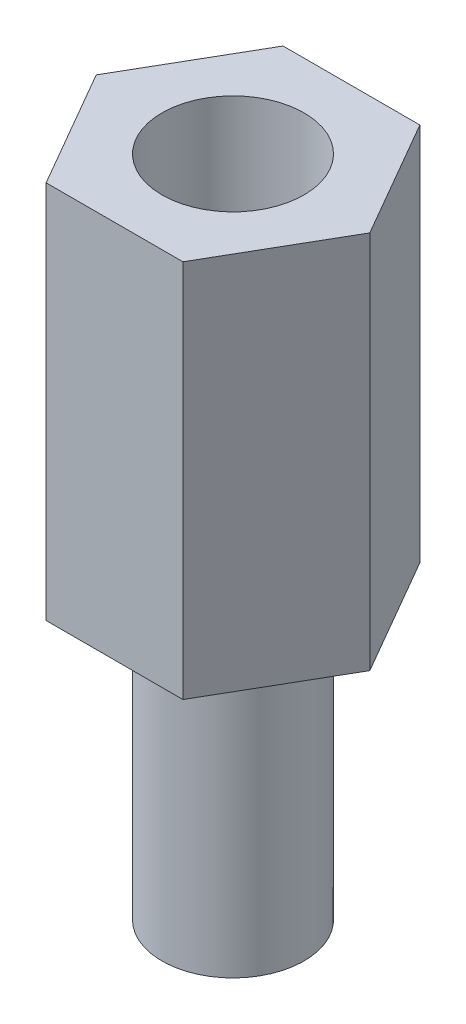
ISO-10303-21;
HEADER;
FILE_DESCRIPTION(('STEP AP214'),'2;1');
FILE_NAME('part.step','',(''),(''),'','','');
FILE_SCHEMA(('AUTOMOTIVE_DESIGN { 1 0 10303 214 1 1 1 1 }'));
ENDSEC;
DATA;
#1=APPLICATION_CONTEXT('core data for automotive mechanical design processes');
#2=APPLICATION_PROTOCOL_DEFINITION('international standard','automotive_design',2000,#1);
#3=PRODUCT_CONTEXT('',#1,'mechanical');
#4=PRODUCT('Part','Part','',(#3));
#5=PRODUCT_RELATED_PRODUCT_CATEGORY('part','',(#4));
#6=PRODUCT_DEFINITION_FORMATION('','',#4);
#7=PRODUCT_DEFINITION_CONTEXT('part definition',#1,'design');
#8=PRODUCT_DEFINITION('design','',#6,#7);
#9=PRODUCT_DEFINITION_SHAPE('','',#8);
#10=(LENGTH_UNIT() NAMED_UNIT(*) SI_UNIT(.MILLI.,.METRE.));
#11=(NAMED_UNIT(*) PLANE_ANGLE_UNIT() SI_UNIT($,.RADIAN.));
#12=(NAMED_UNIT(*) SI_UNIT($,.STERADIAN.) SOLID_ANGLE_UNIT());
#13=UNCERTAINTY_MEASURE_WITH_UNIT(LENGTH_MEASURE(1.E-05),#10,'distance_accuracy_value','');
#14=(GEOMETRIC_REPRESENTATION_CONTEXT(3) GLOBAL_UNCERTAINTY_ASSIGNED_CONTEXT((#13)) GLOBAL_UNIT_ASSIGNED_CONTEXT((#10,
#11,#12)) REPRESENTATION_CONTEXT('',''));
#15=CARTESIAN_POINT('',(0.,0.,0.));
#16=DIRECTION('',(0.,0.,1.));
#17=DIRECTION('',(1.,0.,0.));
#18=AXIS2_PLACEMENT_3D('',#15,#16,#17);
#19=CARTESIAN_POINT('',(0.,-6.,0.));
#20=DIRECTION('',(0.,1.,0.));
#21=DIRECTION('',(0.,0.,1.));
#22=AXIS2_PLACEMENT_3D('',#19,#20,#21);
#23=CYLINDRICAL_SURFACE('',#22,1.5);
#24=CARTESIAN_POINT('',(0.,-6.,0.));
#25=DIRECTION('',(0.,-1.,0.));
#26=DIRECTION('',(0.,0.,-1.));
#27=AXIS2_PLACEMENT_3D('',#24,#25,#26);
#28=CIRCLE('',#27,1.5);
#29=CARTESIAN_POINT('',(0.,-6.,-1.5));
#30=VERTEX_POINT('',#29);
#31=EDGE_CURVE('E11',#30,#30,#28,.T.);
#32=ORIENTED_EDGE('',*,*,#31,.F.);
#33=EDGE_LOOP('',(#32));
#34=FACE_BOUND('',#33,.T.);
#35=CARTESIAN_POINT('',(0.,0.,0.));
#36=DIRECTION('',(0.,-1.,0.));
#37=DIRECTION('',(0.,0.,-1.));
#38=AXIS2_PLACEMENT_3D('',#35,#36,#37);
#39=CIRCLE('',#38,1.5);
#40=CARTESIAN_POINT('',(0.,0.,-1.5));
#41=VERTEX_POINT('',#40);
#42=EDGE_CURVE('E43',#41,#41,#39,.T.);
#43=ORIENTED_EDGE('',*,*,#42,.T.);
#44=EDGE_LOOP('',(#43));
#45=FACE_BOUND('',#44,.T.);
#46=ADVANCED_FACE('F40',(#34,#45),#23,.T.);
#47=CARTESIAN_POINT('',(0.,-6.,0.));
#48=DIRECTION('',(0.,-1.,0.));
#49=DIRECTION('',(0.,0.,-1.));
#50=AXIS2_PLACEMENT_3D('',#47,#48,#49);
#51=PLANE('',#50);
#52=ORIENTED_EDGE('',*,*,#31,.T.);
#53=EDGE_LOOP('',(#52));
#54=FACE_BOUND('',#53,.T.);
#55=ADVANCED_FACE('F55',(#54),#51,.T.);
#56=CARTESIAN_POINT('',(0.,0.,0.));
#57=DIRECTION('',(0.,-1.,0.));
#58=DIRECTION('',(0.,0.,-1.));
#59=AXIS2_PLACEMENT_3D('',#56,#57,#58);
#60=PLANE('',#59);
#61=ORIENTED_EDGE('',*,*,#42,.F.);
#62=EDGE_LOOP('',(#61));
#63=FACE_BOUND('',#62,.T.);
#64=ADVANCED_FACE('F53',(#63),#60,.F.);
#65=CLOSED_SHELL('',(#46,#55,#64));
#66=MANIFOLD_SOLID_BREP('B2',#65);
#67=CARTESIAN_POINT('',(0.,8.,0.));
#68=DIRECTION('',(0.,1.,0.));
#69=DIRECTION('',(0.,0.,1.));
#70=AXIS2_PLACEMENT_3D('',#67,#68,#69);
#71=PLANE('',#70);
#72=DIRECTION('',(1.,0.,0.));
#73=VECTOR('',#72,1.);
#74=CARTESIAN_POINT('',(-1.44337567297405,8.,2.5));
#75=LINE('',#74,#73);
#76=CARTESIAN_POINT('',(-1.44337567297405,8.,2.5));
#77=VERTEX_POINT('',#76);
#78=CARTESIAN_POINT('',(1.44337567297408,8.,2.5));
#79=VERTEX_POINT('',#78);
#80=EDGE_CURVE('E176',#77,#79,#75,.T.);
#81=ORIENTED_EDGE('',*,*,#80,.T.);
#82=DIRECTION('',(0.500000000000001,0.,-0.866025403784438));
#83=VECTOR('',#82,1.);
#84=CARTESIAN_POINT('',(1.44337567297408,8.,2.5));
#85=LINE('',#84,#83);
#86=CARTESIAN_POINT('',(2.88675134594815,8.,0.));
#87=VERTEX_POINT('',#86);
#88=EDGE_CURVE('E134',#79,#87,#85,.T.);
#89=ORIENTED_EDGE('',*,*,#88,.T.);
#90=DIRECTION('',(-0.500000000000001,0.,-0.866025403784438));
#91=VECTOR('',#90,1.);
#92=CARTESIAN_POINT('',(2.88675134594815,8.,0.));
#93=LINE('',#92,#91);
#94=CARTESIAN_POINT('',(1.44337567297408,8.,-2.50000000000001));
#95=VERTEX_POINT('',#94);
#96=EDGE_CURVE('E147',#87,#95,#93,.T.);
#97=ORIENTED_EDGE('',*,*,#96,.T.);
#98=DIRECTION('',(-1.,0.,0.));
#99=VECTOR('',#98,1.);
#100=CARTESIAN_POINT('',(1.44337567297408,8.,-2.50000000000001));
#101=LINE('',#100,#99);
#102=CARTESIAN_POINT('',(-1.44337567297405,8.,-2.50000000000001));
#103=VERTEX_POINT('',#102);
#104=EDGE_CURVE('E141',#95,#103,#101,.T.);
#105=ORIENTED_EDGE('',*,*,#104,.T.);
#106=DIRECTION('',(-0.5,0.,0.866025403784438));
#107=VECTOR('',#106,1.);
#108=CARTESIAN_POINT('',(-1.44337567297405,8.,-2.50000000000001));
#109=LINE('',#108,#107);
#110=CARTESIAN_POINT('',(-2.88675134594812,8.,0.));
#111=VERTEX_POINT('',#110);
#112=EDGE_CURVE('E145',#103,#111,#109,.T.);
#113=ORIENTED_EDGE('',*,*,#112,.T.);
#114=DIRECTION('',(0.5,0.,0.866025403784438));
#115=VECTOR('',#114,1.);
#116=CARTESIAN_POINT('',(-2.88675134594812,8.,0.));
#117=LINE('',#116,#115);
#118=EDGE_CURVE('E97',#111,#77,#117,.T.);
#119=ORIENTED_EDGE('',*,*,#118,.T.);
#120=EDGE_LOOP('',(#81,#89,#97,#105,#113,#119));
#121=FACE_BOUND('',#120,.T.);
#122=CARTESIAN_POINT('',(0.,8.,0.));
#123=DIRECTION('',(0.,1.,0.));
#124=DIRECTION('',(0.,0.,1.));
#125=AXIS2_PLACEMENT_3D('',#122,#123,#124);
#126=CIRCLE('',#125,1.5);
#127=CARTESIAN_POINT('',(0.,8.,1.5));
#128=VERTEX_POINT('',#127);
#129=EDGE_CURVE('E169',#128,#128,#126,.T.);
#130=ORIENTED_EDGE('',*,*,#129,.F.);
#131=EDGE_LOOP('',(#130));
#132=FACE_BOUND('',#131,.T.);
#133=ADVANCED_FACE('F80',(#121,#132),#71,.T.);
#134=CARTESIAN_POINT('',(0.,0.,0.));
#135=DIRECTION('',(0.,1.,0.));
#136=DIRECTION('',(0.,0.,1.));
#137=AXIS2_PLACEMENT_3D('',#134,#135,#136);
#138=PLANE('',#137);
#139=DIRECTION('',(1.,0.,0.));
#140=VECTOR('',#139,1.);
#141=CARTESIAN_POINT('',(-1.44337567297405,0.,2.5));
#142=LINE('',#141,#140);
#143=CARTESIAN_POINT('',(-1.44337567297405,0.,2.5));
#144=VERTEX_POINT('',#143);
#145=CARTESIAN_POINT('',(1.44337567297408,0.,2.5));
#146=VERTEX_POINT('',#145);
#147=EDGE_CURVE('E165',#144,#146,#142,.T.);
#148=ORIENTED_EDGE('',*,*,#147,.F.);
#149=DIRECTION('',(0.5,0.,0.866025403784438));
#150=VECTOR('',#149,1.);
#151=CARTESIAN_POINT('',(-2.88675134594812,0.,0.));
#152=LINE('',#151,#150);
#153=CARTESIAN_POINT('',(-2.88675134594812,0.,0.));
#154=VERTEX_POINT('',#153);
#155=EDGE_CURVE('E126',#154,#144,#152,.T.);
#156=ORIENTED_EDGE('',*,*,#155,.F.);
#157=DIRECTION('',(-0.5,0.,0.866025403784438));
#158=VECTOR('',#157,1.);
#159=CARTESIAN_POINT('',(-1.44337567297405,0.,-2.50000000000001));
#160=LINE('',#159,#158);
#161=CARTESIAN_POINT('',(-1.44337567297405,0.,-2.50000000000001));
#162=VERTEX_POINT('',#161);
#163=EDGE_CURVE('E120',#162,#154,#160,.T.);
#164=ORIENTED_EDGE('',*,*,#163,.F.);
#165=DIRECTION('',(-1.,0.,0.));
#166=VECTOR('',#165,1.);
#167=CARTESIAN_POINT('',(1.44337567297408,0.,-2.50000000000001));
#168=LINE('',#167,#166);
#169=CARTESIAN_POINT('',(1.44337567297408,0.,-2.50000000000001));
#170=VERTEX_POINT('',#169);
#171=EDGE_CURVE('E155',#170,#162,#168,.T.);
#172=ORIENTED_EDGE('',*,*,#171,.F.);
#173=DIRECTION('',(-0.500000000000001,0.,-0.866025403784438));
#174=VECTOR('',#173,1.);
#175=CARTESIAN_POINT('',(2.88675134594815,0.,0.));
#176=LINE('',#175,#174);
#177=CARTESIAN_POINT('',(2.88675134594815,0.,0.));
#178=VERTEX_POINT('',#177);
#179=EDGE_CURVE('E171',#178,#170,#176,.T.);
#180=ORIENTED_EDGE('',*,*,#179,.F.);
#181=DIRECTION('',(0.500000000000001,0.,-0.866025403784438));
#182=VECTOR('',#181,1.);
#183=CARTESIAN_POINT('',(1.44337567297408,0.,2.5));
#184=LINE('',#183,#182);
#185=EDGE_CURVE('E168',#146,#178,#184,.T.);
#186=ORIENTED_EDGE('',*,*,#185,.F.);
#187=EDGE_LOOP('',(#148,#156,#164,#172,#180,#186));
#188=FACE_BOUND('',#187,.T.);
#189=CARTESIAN_POINT('',(0.,0.,0.));
#190=DIRECTION('',(0.,1.,0.));
#191=DIRECTION('',(0.,0.,1.));
#192=AXIS2_PLACEMENT_3D('',#189,#190,#191);
#193=CIRCLE('',#192,1.5);
#194=CARTESIAN_POINT('',(0.,0.,1.5));
#195=VERTEX_POINT('',#194);
#196=EDGE_CURVE('E269',#195,#195,#193,.T.);
#197=ORIENTED_EDGE('',*,*,#196,.T.);
#198=EDGE_LOOP('',(#197));
#199=FACE_BOUND('',#198,.T.);
#200=ADVANCED_FACE('F185',(#188,#199),#138,.F.);
#201=CARTESIAN_POINT('',(-1.44337567297405,8.,2.5));
#202=DIRECTION('',(0.,0.,-1.));
#203=DIRECTION('',(-1.,0.,0.));
#204=AXIS2_PLACEMENT_3D('',#201,#202,#203);
#205=PLANE('',#204);
#206=ORIENTED_EDGE('',*,*,#147,.T.);
#207=DIRECTION('',(0.,-1.,0.));
#208=VECTOR('',#207,1.);
#209=CARTESIAN_POINT('',(1.44337567297408,8.,2.5));
#210=LINE('',#209,#208);
#211=EDGE_CURVE('E38',#79,#146,#210,.T.);
#212=ORIENTED_EDGE('',*,*,#211,.F.);
#213=ORIENTED_EDGE('',*,*,#80,.F.);
#214=DIRECTION('',(0.,-1.,0.));
#215=VECTOR('',#214,1.);
#216=CARTESIAN_POINT('',(-1.44337567297405,8.,2.5));
#217=LINE('',#216,#215);
#218=EDGE_CURVE('E161',#77,#144,#217,.T.);
#219=ORIENTED_EDGE('',*,*,#218,.T.);
#220=EDGE_LOOP('',(#206,#212,#213,#219));
#221=FACE_BOUND('',#220,.T.);
#222=ADVANCED_FACE('F82',(#221),#205,.F.);
#223=CARTESIAN_POINT('',(1.44337567297408,8.,2.5));
#224=DIRECTION('',(-0.866025403784438,0.,-0.500000000000001));
#225=DIRECTION('',(-0.500000000000001,0.,0.866025403784438));
#226=AXIS2_PLACEMENT_3D('',#223,#224,#225);
#227=PLANE('',#226);
#228=ORIENTED_EDGE('',*,*,#185,.T.);
#229=DIRECTION('',(0.,-1.,0.));
#230=VECTOR('',#229,1.);
#231=CARTESIAN_POINT('',(2.88675134594815,8.,0.));
#232=LINE('',#231,#230);
#233=EDGE_CURVE('E89',#87,#178,#232,.T.);
#234=ORIENTED_EDGE('',*,*,#233,.F.);
#235=ORIENTED_EDGE('',*,*,#88,.F.);
#236=ORIENTED_EDGE('',*,*,#211,.T.);
#237=EDGE_LOOP('',(#228,#234,#235,#236));
#238=FACE_BOUND('',#237,.T.);
#239=ADVANCED_FACE('F210',(#238),#227,.F.);
#240=CARTESIAN_POINT('',(2.88675134594815,8.,0.));
#241=DIRECTION('',(-0.866025403784438,0.,0.500000000000001));
#242=DIRECTION('',(0.500000000000001,0.,0.866025403784438));
#243=AXIS2_PLACEMENT_3D('',#240,#241,#242);
#244=PLANE('',#243);
#245=ORIENTED_EDGE('',*,*,#179,.T.);
#246=DIRECTION('',(0.,-1.,0.));
#247=VECTOR('',#246,1.);
#248=CARTESIAN_POINT('',(1.44337567297408,8.,-2.50000000000001));
#249=LINE('',#248,#247);
#250=EDGE_CURVE('E156',#95,#170,#249,.T.);
#251=ORIENTED_EDGE('',*,*,#250,.F.);
#252=ORIENTED_EDGE('',*,*,#96,.F.);
#253=ORIENTED_EDGE('',*,*,#233,.T.);
#254=EDGE_LOOP('',(#245,#251,#252,#253));
#255=FACE_BOUND('',#254,.T.);
#256=ADVANCED_FACE('F182',(#255),#244,.F.);
#257=CARTESIAN_POINT('',(1.44337567297408,8.,-2.50000000000001));
#258=DIRECTION('',(0.,0.,1.));
#259=DIRECTION('',(1.,0.,0.));
#260=AXIS2_PLACEMENT_3D('',#257,#258,#259);
#261=PLANE('',#260);
#262=ORIENTED_EDGE('',*,*,#171,.T.);
#263=DIRECTION('',(0.,-1.,0.));
#264=VECTOR('',#263,1.);
#265=CARTESIAN_POINT('',(-1.44337567297405,8.,-2.50000000000001));
#266=LINE('',#265,#264);
#267=EDGE_CURVE('E152',#103,#162,#266,.T.);
#268=ORIENTED_EDGE('',*,*,#267,.F.);
#269=ORIENTED_EDGE('',*,*,#104,.F.);
#270=ORIENTED_EDGE('',*,*,#250,.T.);
#271=EDGE_LOOP('',(#262,#268,#269,#270));
#272=FACE_BOUND('',#271,.T.);
#273=ADVANCED_FACE('F153',(#272),#261,.F.);
#274=CARTESIAN_POINT('',(-1.44337567297405,8.,-2.50000000000001));
#275=DIRECTION('',(0.866025403784439,0.,0.5));
#276=DIRECTION('',(0.5,0.,-0.866025403784439));
#277=AXIS2_PLACEMENT_3D('',#274,#275,#276);
#278=PLANE('',#277);
#279=ORIENTED_EDGE('',*,*,#163,.T.);
#280=DIRECTION('',(0.,-1.,0.));
#281=VECTOR('',#280,1.);
#282=CARTESIAN_POINT('',(-2.88675134594812,8.,0.));
#283=LINE('',#282,#281);
#284=EDGE_CURVE('E157',#111,#154,#283,.T.);
#285=ORIENTED_EDGE('',*,*,#284,.F.);
#286=ORIENTED_EDGE('',*,*,#112,.F.);
#287=ORIENTED_EDGE('',*,*,#267,.T.);
#288=EDGE_LOOP('',(#279,#285,#286,#287));
#289=FACE_BOUND('',#288,.T.);
#290=ADVANCED_FACE('F159',(#289),#278,.F.);
#291=CARTESIAN_POINT('',(-2.88675134594812,8.,0.));
#292=DIRECTION('',(0.866025403784438,0.,-0.5));
#293=DIRECTION('',(-0.5,0.,-0.866025403784438));
#294=AXIS2_PLACEMENT_3D('',#291,#292,#293);
#295=PLANE('',#294);
#296=ORIENTED_EDGE('',*,*,#155,.T.);
#297=ORIENTED_EDGE('',*,*,#218,.F.);
#298=ORIENTED_EDGE('',*,*,#118,.F.);
#299=ORIENTED_EDGE('',*,*,#284,.T.);
#300=EDGE_LOOP('',(#296,#297,#298,#299));
#301=FACE_BOUND('',#300,.T.);
#302=ADVANCED_FACE('F190',(#301),#295,.F.);
#303=CARTESIAN_POINT('',(0.,8.,0.));
#304=DIRECTION('',(0.,-1.,0.));
#305=DIRECTION('',(0.,0.,-1.));
#306=AXIS2_PLACEMENT_3D('',#303,#304,#305);
#307=CYLINDRICAL_SURFACE('',#306,1.5);
#308=ORIENTED_EDGE('',*,*,#129,.T.);
#309=EDGE_LOOP('',(#308));
#310=FACE_BOUND('',#309,.T.);
#311=ORIENTED_EDGE('',*,*,#196,.F.);
#312=EDGE_LOOP('',(#311));
#313=FACE_BOUND('',#312,.T.);
#314=ADVANCED_FACE('F192',(#310,#313),#307,.F.);
#315=CLOSED_SHELL('',(#133,#200,#222,#239,#256,#273,#290,#302,#314));
#316=MANIFOLD_SOLID_BREP('B6',#315);
#317=ADVANCED_BREP_SHAPE_REPRESENTATION('',(#18,#66,#316),#14);
#318=SHAPE_DEFINITION_REPRESENTATION(#9,#317);
ENDSEC;
END-ISO-10303-21;
